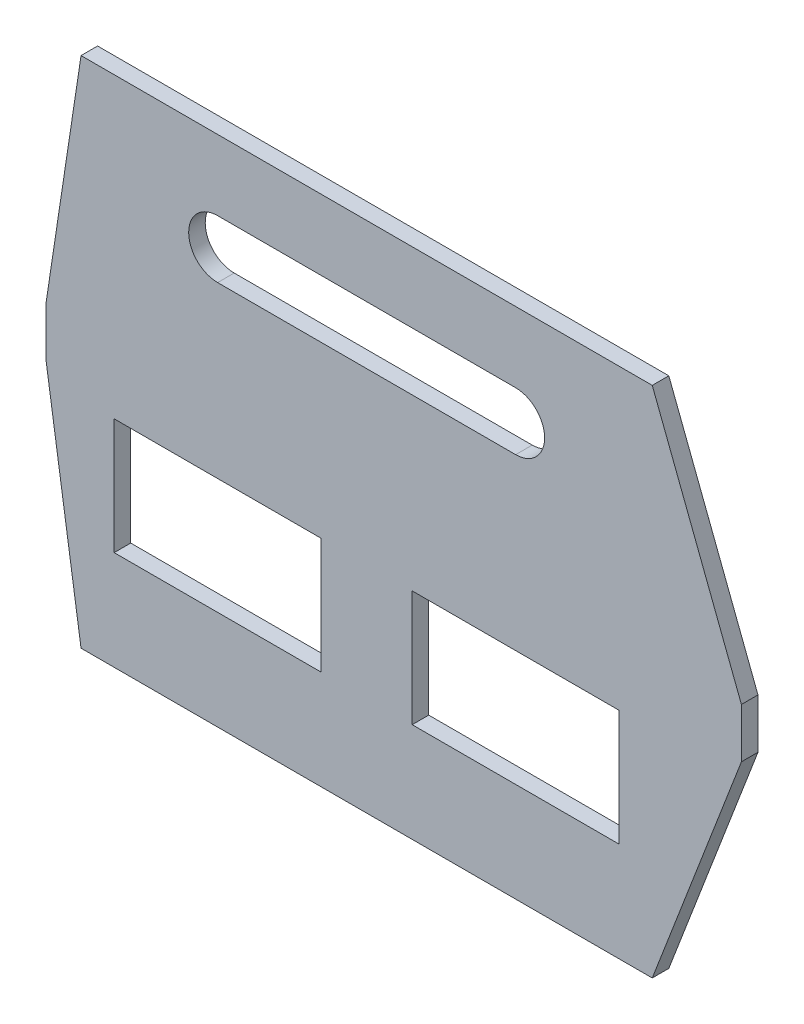
ISO-10303-21;
HEADER;
FILE_DESCRIPTION(('STEP AP214'),'2;1');
FILE_NAME('part.step','',(''),(''),'','','');
FILE_SCHEMA(('AUTOMOTIVE_DESIGN { 1 0 10303 214 1 1 1 1 }'));
ENDSEC;
DATA;
#1=APPLICATION_CONTEXT('core data for automotive mechanical design processes');
#2=APPLICATION_PROTOCOL_DEFINITION('international standard','automotive_design',2000,#1);
#3=PRODUCT_CONTEXT('',#1,'mechanical');
#4=PRODUCT('Part','Part','',(#3));
#5=PRODUCT_RELATED_PRODUCT_CATEGORY('part','',(#4));
#6=PRODUCT_DEFINITION_FORMATION('','',#4);
#7=PRODUCT_DEFINITION_CONTEXT('part definition',#1,'design');
#8=PRODUCT_DEFINITION('design','',#6,#7);
#9=PRODUCT_DEFINITION_SHAPE('','',#8);
#10=(LENGTH_UNIT() NAMED_UNIT(*) SI_UNIT(.MILLI.,.METRE.));
#11=(NAMED_UNIT(*) PLANE_ANGLE_UNIT() SI_UNIT($,.RADIAN.));
#12=(NAMED_UNIT(*) SI_UNIT($,.STERADIAN.) SOLID_ANGLE_UNIT());
#13=UNCERTAINTY_MEASURE_WITH_UNIT(LENGTH_MEASURE(1.E-05),#10,'distance_accuracy_value','');
#14=(GEOMETRIC_REPRESENTATION_CONTEXT(3) GLOBAL_UNCERTAINTY_ASSIGNED_CONTEXT((#13)) GLOBAL_UNIT_ASSIGNED_CONTEXT((#10,
#11,#12)) REPRESENTATION_CONTEXT('',''));
#15=CARTESIAN_POINT('',(0.,0.,0.));
#16=DIRECTION('',(0.,0.,1.));
#17=DIRECTION('',(1.,0.,0.));
#18=AXIS2_PLACEMENT_3D('',#15,#16,#17);
#19=CARTESIAN_POINT('',(0.,0.,10.));
#20=DIRECTION('',(0.,0.,-1.));
#21=DIRECTION('',(-1.,0.,0.));
#22=AXIS2_PLACEMENT_3D('',#19,#20,#21);
#23=PLANE('',#22);
#24=DIRECTION('',(0.,-1.,0.));
#25=VECTOR('',#24,1.);
#26=CARTESIAN_POINT('',(-325.,130.,10.));
#27=LINE('',#26,#25);
#28=CARTESIAN_POINT('',(-325.,130.,10.));
#29=VERTEX_POINT('',#28);
#30=CARTESIAN_POINT('',(-325.,60.,10.));
#31=VERTEX_POINT('',#30);
#32=EDGE_CURVE('E229',#29,#31,#27,.T.);
#33=ORIENTED_EDGE('',*,*,#32,.F.);
#34=DIRECTION('',(-1.,0.,0.));
#35=VECTOR('',#34,1.);
#36=CARTESIAN_POINT('',(-325.,130.,10.));
#37=LINE('',#36,#35);
#38=CARTESIAN_POINT('',(-200.,130.,10.));
#39=VERTEX_POINT('',#38);
#40=EDGE_CURVE('E240',#39,#29,#37,.T.);
#41=ORIENTED_EDGE('',*,*,#40,.F.);
#42=DIRECTION('',(0.,1.,0.));
#43=VECTOR('',#42,1.);
#44=CARTESIAN_POINT('',(-200.,130.,10.));
#45=LINE('',#44,#43);
#46=CARTESIAN_POINT('',(-200.,60.,10.));
#47=VERTEX_POINT('',#46);
#48=EDGE_CURVE('E236',#47,#39,#45,.T.);
#49=ORIENTED_EDGE('',*,*,#48,.F.);
#50=DIRECTION('',(1.,0.,0.));
#51=VECTOR('',#50,1.);
#52=CARTESIAN_POINT('',(-325.,60.,10.));
#53=LINE('',#52,#51);
#54=EDGE_CURVE('E232',#31,#47,#53,.T.);
#55=ORIENTED_EDGE('',*,*,#54,.F.);
#56=EDGE_LOOP('',(#33,#41,#49,#55));
#57=FACE_BOUND('',#56,.T.);
#58=DIRECTION('',(0.359010987142301,0.933333333333333,0.));
#59=VECTOR('',#58,1.);
#60=CARTESIAN_POINT('',(53.8516480713451,140.,10.));
#61=LINE('',#60,#59);
#62=CARTESIAN_POINT('',(0.,0.,10.));
#63=VERTEX_POINT('',#62);
#64=CARTESIAN_POINT('',(53.8516480713451,140.,10.));
#65=VERTEX_POINT('',#64);
#66=EDGE_CURVE('E315',#63,#65,#61,.T.);
#67=ORIENTED_EDGE('',*,*,#66,.T.);
#68=DIRECTION('',(0.,1.,0.));
#69=VECTOR('',#68,1.);
#70=CARTESIAN_POINT('',(53.8516480713451,170.,10.));
#71=LINE('',#70,#69);
#72=CARTESIAN_POINT('',(53.8516480713451,170.,10.));
#73=VERTEX_POINT('',#72);
#74=EDGE_CURVE('E319',#65,#73,#71,.T.);
#75=ORIENTED_EDGE('',*,*,#74,.T.);
#76=DIRECTION('',(-0.359010987142301,0.933333333333333,0.));
#77=VECTOR('',#76,1.);
#78=CARTESIAN_POINT('',(0.,310.,10.));
#79=LINE('',#78,#77);
#80=CARTESIAN_POINT('',(0.,310.,10.));
#81=VERTEX_POINT('',#80);
#82=EDGE_CURVE('E323',#73,#81,#79,.T.);
#83=ORIENTED_EDGE('',*,*,#82,.T.);
#84=DIRECTION('',(-1.,0.,0.));
#85=VECTOR('',#84,1.);
#86=CARTESIAN_POINT('',(-345.,310.,10.));
#87=LINE('',#86,#85);
#88=CARTESIAN_POINT('',(-345.,310.,10.));
#89=VERTEX_POINT('',#88);
#90=EDGE_CURVE('E326',#81,#89,#87,.T.);
#91=ORIENTED_EDGE('',*,*,#90,.T.);
#92=DIRECTION('',(-0.149365086770144,-0.988782114954628,0.));
#93=VECTOR('',#92,1.);
#94=CARTESIAN_POINT('',(-366.148351928655,170.,10.));
#95=LINE('',#94,#93);
#96=CARTESIAN_POINT('',(-366.148351928655,170.,10.));
#97=VERTEX_POINT('',#96);
#98=EDGE_CURVE('E329',#89,#97,#95,.T.);
#99=ORIENTED_EDGE('',*,*,#98,.T.);
#100=DIRECTION('',(0.,-1.,0.));
#101=VECTOR('',#100,1.);
#102=CARTESIAN_POINT('',(-366.148351928655,140.,10.));
#103=LINE('',#102,#101);
#104=CARTESIAN_POINT('',(-366.148351928655,140.,10.));
#105=VERTEX_POINT('',#104);
#106=EDGE_CURVE('E332',#97,#105,#103,.T.);
#107=ORIENTED_EDGE('',*,*,#106,.T.);
#108=DIRECTION('',(0.149365086770144,-0.988782114954628,0.));
#109=VECTOR('',#108,1.);
#110=CARTESIAN_POINT('',(-345.,0.,10.));
#111=LINE('',#110,#109);
#112=CARTESIAN_POINT('',(-345.,0.,10.));
#113=VERTEX_POINT('',#112);
#114=EDGE_CURVE('E335',#105,#113,#111,.T.);
#115=ORIENTED_EDGE('',*,*,#114,.T.);
#116=DIRECTION('',(1.,0.,0.));
#117=VECTOR('',#116,1.);
#118=CARTESIAN_POINT('',(0.,0.,10.));
#119=LINE('',#118,#117);
#120=EDGE_CURVE('E338',#113,#63,#119,.T.);
#121=ORIENTED_EDGE('',*,*,#120,.T.);
#122=EDGE_LOOP('',(#67,#75,#83,#91,#99,#107,#115,#121));
#123=FACE_BOUND('',#122,.T.);
#124=CARTESIAN_POINT('',(-262.5,250.,10.));
#125=DIRECTION('',(0.,0.,1.));
#126=DIRECTION('',(1.,0.,0.));
#127=AXIS2_PLACEMENT_3D('',#124,#125,#126);
#128=CIRCLE('',#127,17.5);
#129=CARTESIAN_POINT('',(-262.5,267.5,10.));
#130=VERTEX_POINT('',#129);
#131=CARTESIAN_POINT('',(-262.5,232.5,10.));
#132=VERTEX_POINT('',#131);
#133=EDGE_CURVE('E272',#130,#132,#128,.T.);
#134=ORIENTED_EDGE('',*,*,#133,.F.);
#135=DIRECTION('',(-1.,0.,0.));
#136=VECTOR('',#135,1.);
#137=CARTESIAN_POINT('',(-262.5,267.5,10.));
#138=LINE('',#137,#136);
#139=CARTESIAN_POINT('',(-82.4999999999999,267.5,10.));
#140=VERTEX_POINT('',#139);
#141=EDGE_CURVE('E283',#140,#130,#138,.T.);
#142=ORIENTED_EDGE('',*,*,#141,.F.);
#143=CARTESIAN_POINT('',(-82.4999999999999,250.,10.));
#144=DIRECTION('',(0.,0.,1.));
#145=DIRECTION('',(1.,0.,0.));
#146=AXIS2_PLACEMENT_3D('',#143,#144,#145);
#147=CIRCLE('',#146,17.5);
#148=CARTESIAN_POINT('',(-82.4999999999999,232.5,10.));
#149=VERTEX_POINT('',#148);
#150=EDGE_CURVE('E279',#149,#140,#147,.T.);
#151=ORIENTED_EDGE('',*,*,#150,.F.);
#152=DIRECTION('',(1.,0.,0.));
#153=VECTOR('',#152,1.);
#154=CARTESIAN_POINT('',(-262.5,232.5,10.));
#155=LINE('',#154,#153);
#156=EDGE_CURVE('E275',#132,#149,#155,.T.);
#157=ORIENTED_EDGE('',*,*,#156,.F.);
#158=EDGE_LOOP('',(#134,#142,#151,#157));
#159=FACE_BOUND('',#158,.T.);
#160=DIRECTION('',(0.,1.,0.));
#161=VECTOR('',#160,1.);
#162=CARTESIAN_POINT('',(-20.,130.,10.));
#163=LINE('',#162,#161);
#164=CARTESIAN_POINT('',(-20.,60.,10.));
#165=VERTEX_POINT('',#164);
#166=CARTESIAN_POINT('',(-20.,130.,10.));
#167=VERTEX_POINT('',#166);
#168=EDGE_CURVE('E181',#165,#167,#163,.T.);
#169=ORIENTED_EDGE('',*,*,#168,.F.);
#170=DIRECTION('',(1.,0.,0.));
#171=VECTOR('',#170,1.);
#172=CARTESIAN_POINT('',(-20.,60.,10.));
#173=LINE('',#172,#171);
#174=CARTESIAN_POINT('',(-145.,60.,10.));
#175=VERTEX_POINT('',#174);
#176=EDGE_CURVE('E207',#175,#165,#173,.T.);
#177=ORIENTED_EDGE('',*,*,#176,.F.);
#178=DIRECTION('',(0.,-1.,0.));
#179=VECTOR('',#178,1.);
#180=CARTESIAN_POINT('',(-145.,130.,10.));
#181=LINE('',#180,#179);
#182=CARTESIAN_POINT('',(-145.,130.,10.));
#183=VERTEX_POINT('',#182);
#184=EDGE_CURVE('E203',#183,#175,#181,.T.);
#185=ORIENTED_EDGE('',*,*,#184,.F.);
#186=DIRECTION('',(-1.,0.,0.));
#187=VECTOR('',#186,1.);
#188=CARTESIAN_POINT('',(-20.,130.,10.));
#189=LINE('',#188,#187);
#190=EDGE_CURVE('E190',#167,#183,#189,.T.);
#191=ORIENTED_EDGE('',*,*,#190,.F.);
#192=EDGE_LOOP('',(#169,#177,#185,#191));
#193=FACE_BOUND('',#192,.T.);
#194=ADVANCED_FACE('F43',(#57,#123,#159,#193),#23,.F.);
#195=CARTESIAN_POINT('',(0.,0.,0.));
#196=DIRECTION('',(0.,0.,-1.));
#197=DIRECTION('',(-1.,0.,0.));
#198=AXIS2_PLACEMENT_3D('',#195,#196,#197);
#199=PLANE('',#198);
#200=DIRECTION('',(0.359010987142301,0.933333333333333,0.));
#201=VECTOR('',#200,1.);
#202=CARTESIAN_POINT('',(53.8516480713451,140.,0.));
#203=LINE('',#202,#201);
#204=CARTESIAN_POINT('',(0.,0.,0.));
#205=VERTEX_POINT('',#204);
#206=CARTESIAN_POINT('',(53.8516480713451,140.,0.));
#207=VERTEX_POINT('',#206);
#208=EDGE_CURVE('E314',#205,#207,#203,.T.);
#209=ORIENTED_EDGE('',*,*,#208,.F.);
#210=DIRECTION('',(1.,0.,0.));
#211=VECTOR('',#210,1.);
#212=CARTESIAN_POINT('',(0.,0.,0.));
#213=LINE('',#212,#211);
#214=CARTESIAN_POINT('',(-345.,0.,0.));
#215=VERTEX_POINT('',#214);
#216=EDGE_CURVE('E320',#215,#205,#213,.T.);
#217=ORIENTED_EDGE('',*,*,#216,.F.);
#218=DIRECTION('',(0.149365086770144,-0.988782114954628,0.));
#219=VECTOR('',#218,1.);
#220=CARTESIAN_POINT('',(-345.,0.,0.));
#221=LINE('',#220,#219);
#222=CARTESIAN_POINT('',(-366.148351928655,140.,0.));
#223=VERTEX_POINT('',#222);
#224=EDGE_CURVE('E360',#223,#215,#221,.T.);
#225=ORIENTED_EDGE('',*,*,#224,.F.);
#226=DIRECTION('',(0.,-1.,0.));
#227=VECTOR('',#226,1.);
#228=CARTESIAN_POINT('',(-366.148351928655,140.,0.));
#229=LINE('',#228,#227);
#230=CARTESIAN_POINT('',(-366.148351928655,170.,0.));
#231=VERTEX_POINT('',#230);
#232=EDGE_CURVE('E357',#231,#223,#229,.T.);
#233=ORIENTED_EDGE('',*,*,#232,.F.);
#234=DIRECTION('',(-0.149365086770144,-0.988782114954628,0.));
#235=VECTOR('',#234,1.);
#236=CARTESIAN_POINT('',(-366.148351928655,170.,0.));
#237=LINE('',#236,#235);
#238=CARTESIAN_POINT('',(-345.,310.,0.));
#239=VERTEX_POINT('',#238);
#240=EDGE_CURVE('E354',#239,#231,#237,.T.);
#241=ORIENTED_EDGE('',*,*,#240,.F.);
#242=DIRECTION('',(-1.,0.,0.));
#243=VECTOR('',#242,1.);
#244=CARTESIAN_POINT('',(-345.,310.,0.));
#245=LINE('',#244,#243);
#246=CARTESIAN_POINT('',(0.,310.,0.));
#247=VERTEX_POINT('',#246);
#248=EDGE_CURVE('E351',#247,#239,#245,.T.);
#249=ORIENTED_EDGE('',*,*,#248,.F.);
#250=DIRECTION('',(-0.359010987142301,0.933333333333333,0.));
#251=VECTOR('',#250,1.);
#252=CARTESIAN_POINT('',(0.,310.,0.));
#253=LINE('',#252,#251);
#254=CARTESIAN_POINT('',(53.8516480713451,170.,0.));
#255=VERTEX_POINT('',#254);
#256=EDGE_CURVE('E348',#255,#247,#253,.T.);
#257=ORIENTED_EDGE('',*,*,#256,.F.);
#258=DIRECTION('',(0.,1.,0.));
#259=VECTOR('',#258,1.);
#260=CARTESIAN_POINT('',(53.8516480713451,170.,0.));
#261=LINE('',#260,#259);
#262=EDGE_CURVE('E345',#207,#255,#261,.T.);
#263=ORIENTED_EDGE('',*,*,#262,.F.);
#264=EDGE_LOOP('',(#209,#217,#225,#233,#241,#249,#257,#263));
#265=FACE_BOUND('',#264,.T.);
#266=DIRECTION('',(-1.,0.,0.));
#267=VECTOR('',#266,1.);
#268=CARTESIAN_POINT('',(-262.5,267.5,0.));
#269=LINE('',#268,#267);
#270=CARTESIAN_POINT('',(-82.4999999999999,267.5,0.));
#271=VERTEX_POINT('',#270);
#272=CARTESIAN_POINT('',(-262.5,267.5,0.));
#273=VERTEX_POINT('',#272);
#274=EDGE_CURVE('E276',#271,#273,#269,.T.);
#275=ORIENTED_EDGE('',*,*,#274,.T.);
#276=CARTESIAN_POINT('',(-262.5,250.,0.));
#277=DIRECTION('',(0.,0.,1.));
#278=DIRECTION('',(1.,0.,0.));
#279=AXIS2_PLACEMENT_3D('',#276,#277,#278);
#280=CIRCLE('',#279,17.5);
#281=CARTESIAN_POINT('',(-262.5,232.5,0.));
#282=VERTEX_POINT('',#281);
#283=EDGE_CURVE('E271',#273,#282,#280,.T.);
#284=ORIENTED_EDGE('',*,*,#283,.T.);
#285=DIRECTION('',(1.,0.,0.));
#286=VECTOR('',#285,1.);
#287=CARTESIAN_POINT('',(-262.5,232.5,0.));
#288=LINE('',#287,#286);
#289=CARTESIAN_POINT('',(-82.4999999999999,232.5,0.));
#290=VERTEX_POINT('',#289);
#291=EDGE_CURVE('E290',#282,#290,#288,.T.);
#292=ORIENTED_EDGE('',*,*,#291,.T.);
#293=CARTESIAN_POINT('',(-82.4999999999999,250.,0.));
#294=DIRECTION('',(0.,0.,1.));
#295=DIRECTION('',(1.,0.,0.));
#296=AXIS2_PLACEMENT_3D('',#293,#294,#295);
#297=CIRCLE('',#296,17.5);
#298=EDGE_CURVE('E294',#290,#271,#297,.T.);
#299=ORIENTED_EDGE('',*,*,#298,.T.);
#300=EDGE_LOOP('',(#275,#284,#292,#299));
#301=FACE_BOUND('',#300,.T.);
#302=DIRECTION('',(-1.,0.,0.));
#303=VECTOR('',#302,1.);
#304=CARTESIAN_POINT('',(-325.,130.,0.));
#305=LINE('',#304,#303);
#306=CARTESIAN_POINT('',(-200.,130.,0.));
#307=VERTEX_POINT('',#306);
#308=CARTESIAN_POINT('',(-325.,130.,0.));
#309=VERTEX_POINT('',#308);
#310=EDGE_CURVE('E233',#307,#309,#305,.T.);
#311=ORIENTED_EDGE('',*,*,#310,.T.);
#312=DIRECTION('',(0.,-1.,0.));
#313=VECTOR('',#312,1.);
#314=CARTESIAN_POINT('',(-325.,130.,0.));
#315=LINE('',#314,#313);
#316=CARTESIAN_POINT('',(-325.,60.,0.));
#317=VERTEX_POINT('',#316);
#318=EDGE_CURVE('E199',#309,#317,#315,.T.);
#319=ORIENTED_EDGE('',*,*,#318,.T.);
#320=DIRECTION('',(1.,0.,0.));
#321=VECTOR('',#320,1.);
#322=CARTESIAN_POINT('',(-325.,60.,0.));
#323=LINE('',#322,#321);
#324=CARTESIAN_POINT('',(-200.,60.,0.));
#325=VERTEX_POINT('',#324);
#326=EDGE_CURVE('E247',#317,#325,#323,.T.);
#327=ORIENTED_EDGE('',*,*,#326,.T.);
#328=DIRECTION('',(0.,1.,0.));
#329=VECTOR('',#328,1.);
#330=CARTESIAN_POINT('',(-200.,130.,0.));
#331=LINE('',#330,#329);
#332=EDGE_CURVE('E251',#325,#307,#331,.T.);
#333=ORIENTED_EDGE('',*,*,#332,.T.);
#334=EDGE_LOOP('',(#311,#319,#327,#333));
#335=FACE_BOUND('',#334,.T.);
#336=DIRECTION('',(1.,0.,0.));
#337=VECTOR('',#336,1.);
#338=CARTESIAN_POINT('',(-20.,60.,0.));
#339=LINE('',#338,#337);
#340=CARTESIAN_POINT('',(-145.,60.,0.));
#341=VERTEX_POINT('',#340);
#342=CARTESIAN_POINT('',(-20.,60.,0.));
#343=VERTEX_POINT('',#342);
#344=EDGE_CURVE('E191',#341,#343,#339,.T.);
#345=ORIENTED_EDGE('',*,*,#344,.T.);
#346=DIRECTION('',(0.,1.,0.));
#347=VECTOR('',#346,1.);
#348=CARTESIAN_POINT('',(-20.,130.,0.));
#349=LINE('',#348,#347);
#350=CARTESIAN_POINT('',(-20.,130.,0.));
#351=VERTEX_POINT('',#350);
#352=EDGE_CURVE('E67',#343,#351,#349,.T.);
#353=ORIENTED_EDGE('',*,*,#352,.T.);
#354=DIRECTION('',(-1.,0.,0.));
#355=VECTOR('',#354,1.);
#356=CARTESIAN_POINT('',(-20.,130.,0.));
#357=LINE('',#356,#355);
#358=CARTESIAN_POINT('',(-145.,130.,0.));
#359=VERTEX_POINT('',#358);
#360=EDGE_CURVE('E197',#351,#359,#357,.T.);
#361=ORIENTED_EDGE('',*,*,#360,.T.);
#362=DIRECTION('',(0.,-1.,0.));
#363=VECTOR('',#362,1.);
#364=CARTESIAN_POINT('',(-145.,130.,0.));
#365=LINE('',#364,#363);
#366=EDGE_CURVE('E216',#359,#341,#365,.T.);
#367=ORIENTED_EDGE('',*,*,#366,.T.);
#368=EDGE_LOOP('',(#345,#353,#361,#367));
#369=FACE_BOUND('',#368,.T.);
#370=ADVANCED_FACE('F399',(#265,#301,#335,#369),#199,.T.);
#371=CARTESIAN_POINT('',(53.8516480713451,140.,10.));
#372=DIRECTION('',(-0.933333333333333,0.359010987142301,0.));
#373=DIRECTION('',(-0.359010987142301,-0.933333333333333,0.));
#374=AXIS2_PLACEMENT_3D('',#371,#372,#373);
#375=PLANE('',#374);
#376=ORIENTED_EDGE('',*,*,#208,.T.);
#377=DIRECTION('',(0.,0.,-1.));
#378=VECTOR('',#377,1.);
#379=CARTESIAN_POINT('',(53.8516480713451,140.,10.));
#380=LINE('',#379,#378);
#381=EDGE_CURVE('E11',#65,#207,#380,.T.);
#382=ORIENTED_EDGE('',*,*,#381,.F.);
#383=ORIENTED_EDGE('',*,*,#66,.F.);
#384=DIRECTION('',(0.,0.,-1.));
#385=VECTOR('',#384,1.);
#386=CARTESIAN_POINT('',(0.,0.,10.));
#387=LINE('',#386,#385);
#388=EDGE_CURVE('E341',#63,#205,#387,.T.);
#389=ORIENTED_EDGE('',*,*,#388,.T.);
#390=EDGE_LOOP('',(#376,#382,#383,#389));
#391=FACE_BOUND('',#390,.T.);
#392=ADVANCED_FACE('F45',(#391),#375,.F.);
#393=CARTESIAN_POINT('',(53.8516480713451,170.,10.));
#394=DIRECTION('',(-1.,0.,0.));
#395=DIRECTION('',(0.,-1.,0.));
#396=AXIS2_PLACEMENT_3D('',#393,#394,#395);
#397=PLANE('',#396);
#398=ORIENTED_EDGE('',*,*,#262,.T.);
#399=DIRECTION('',(0.,0.,-1.));
#400=VECTOR('',#399,1.);
#401=CARTESIAN_POINT('',(53.8516480713451,170.,10.));
#402=LINE('',#401,#400);
#403=EDGE_CURVE('E52',#73,#255,#402,.T.);
#404=ORIENTED_EDGE('',*,*,#403,.F.);
#405=ORIENTED_EDGE('',*,*,#74,.F.);
#406=ORIENTED_EDGE('',*,*,#381,.T.);
#407=EDGE_LOOP('',(#398,#404,#405,#406));
#408=FACE_BOUND('',#407,.T.);
#409=ADVANCED_FACE('F417',(#408),#397,.F.);
#410=CARTESIAN_POINT('',(0.,310.,10.));
#411=DIRECTION('',(-0.933333333333333,-0.359010987142301,0.));
#412=DIRECTION('',(0.359010987142301,-0.933333333333333,0.));
#413=AXIS2_PLACEMENT_3D('',#410,#411,#412);
#414=PLANE('',#413);
#415=ORIENTED_EDGE('',*,*,#256,.T.);
#416=DIRECTION('',(0.,0.,-1.));
#417=VECTOR('',#416,1.);
#418=CARTESIAN_POINT('',(0.,310.,10.));
#419=LINE('',#418,#417);
#420=EDGE_CURVE('E384',#81,#247,#419,.T.);
#421=ORIENTED_EDGE('',*,*,#420,.F.);
#422=ORIENTED_EDGE('',*,*,#82,.F.);
#423=ORIENTED_EDGE('',*,*,#403,.T.);
#424=EDGE_LOOP('',(#415,#421,#422,#423));
#425=FACE_BOUND('',#424,.T.);
#426=ADVANCED_FACE('F393',(#425),#414,.F.);
#427=CARTESIAN_POINT('',(-345.,310.,10.));
#428=DIRECTION('',(0.,-1.,0.));
#429=DIRECTION('',(1.,0.,0.));
#430=AXIS2_PLACEMENT_3D('',#427,#428,#429);
#431=PLANE('',#430);
#432=ORIENTED_EDGE('',*,*,#248,.T.);
#433=DIRECTION('',(0.,0.,-1.));
#434=VECTOR('',#433,1.);
#435=CARTESIAN_POINT('',(-345.,310.,10.));
#436=LINE('',#435,#434);
#437=EDGE_CURVE('E380',#89,#239,#436,.T.);
#438=ORIENTED_EDGE('',*,*,#437,.F.);
#439=ORIENTED_EDGE('',*,*,#90,.F.);
#440=ORIENTED_EDGE('',*,*,#420,.T.);
#441=EDGE_LOOP('',(#432,#438,#439,#440));
#442=FACE_BOUND('',#441,.T.);
#443=ADVANCED_FACE('F405',(#442),#431,.F.);
#444=CARTESIAN_POINT('',(-366.148351928655,170.,10.));
#445=DIRECTION('',(0.988782114954628,-0.149365086770144,0.));
#446=DIRECTION('',(0.149365086770144,0.988782114954628,0.));
#447=AXIS2_PLACEMENT_3D('',#444,#445,#446);
#448=PLANE('',#447);
#449=ORIENTED_EDGE('',*,*,#240,.T.);
#450=DIRECTION('',(0.,0.,-1.));
#451=VECTOR('',#450,1.);
#452=CARTESIAN_POINT('',(-366.148351928655,170.,10.));
#453=LINE('',#452,#451);
#454=EDGE_CURVE('E376',#97,#231,#453,.T.);
#455=ORIENTED_EDGE('',*,*,#454,.F.);
#456=ORIENTED_EDGE('',*,*,#98,.F.);
#457=ORIENTED_EDGE('',*,*,#437,.T.);
#458=EDGE_LOOP('',(#449,#455,#456,#457));
#459=FACE_BOUND('',#458,.T.);
#460=ADVANCED_FACE('F409',(#459),#448,.F.);
#461=CARTESIAN_POINT('',(-366.148351928655,140.,10.));
#462=DIRECTION('',(1.,0.,0.));
#463=DIRECTION('',(0.,0.,-1.));
#464=AXIS2_PLACEMENT_3D('',#461,#462,#463);
#465=PLANE('',#464);
#466=ORIENTED_EDGE('',*,*,#232,.T.);
#467=DIRECTION('',(0.,0.,-1.));
#468=VECTOR('',#467,1.);
#469=CARTESIAN_POINT('',(-366.148351928655,140.,10.));
#470=LINE('',#469,#468);
#471=EDGE_CURVE('E372',#105,#223,#470,.T.);
#472=ORIENTED_EDGE('',*,*,#471,.F.);
#473=ORIENTED_EDGE('',*,*,#106,.F.);
#474=ORIENTED_EDGE('',*,*,#454,.T.);
#475=EDGE_LOOP('',(#466,#472,#473,#474));
#476=FACE_BOUND('',#475,.T.);
#477=ADVANCED_FACE('F430',(#476),#465,.F.);
#478=CARTESIAN_POINT('',(-345.,0.,10.));
#479=DIRECTION('',(0.988782114954628,0.149365086770144,0.));
#480=DIRECTION('',(-0.149365086770144,0.988782114954628,0.));
#481=AXIS2_PLACEMENT_3D('',#478,#479,#480);
#482=PLANE('',#481);
#483=ORIENTED_EDGE('',*,*,#224,.T.);
#484=DIRECTION('',(0.,0.,-1.));
#485=VECTOR('',#484,1.);
#486=CARTESIAN_POINT('',(-345.,0.,10.));
#487=LINE('',#486,#485);
#488=EDGE_CURVE('E368',#113,#215,#487,.T.);
#489=ORIENTED_EDGE('',*,*,#488,.F.);
#490=ORIENTED_EDGE('',*,*,#114,.F.);
#491=ORIENTED_EDGE('',*,*,#471,.T.);
#492=EDGE_LOOP('',(#483,#489,#490,#491));
#493=FACE_BOUND('',#492,.T.);
#494=ADVANCED_FACE('F428',(#493),#482,.F.);
#495=CARTESIAN_POINT('',(0.,0.,10.));
#496=DIRECTION('',(0.,1.,0.));
#497=DIRECTION('',(-1.,0.,0.));
#498=AXIS2_PLACEMENT_3D('',#495,#496,#497);
#499=PLANE('',#498);
#500=ORIENTED_EDGE('',*,*,#216,.T.);
#501=ORIENTED_EDGE('',*,*,#388,.F.);
#502=ORIENTED_EDGE('',*,*,#120,.F.);
#503=ORIENTED_EDGE('',*,*,#488,.T.);
#504=EDGE_LOOP('',(#500,#501,#502,#503));
#505=FACE_BOUND('',#504,.T.);
#506=ADVANCED_FACE('F423',(#505),#499,.F.);
#507=CARTESIAN_POINT('',(-262.5,250.,10.));
#508=DIRECTION('',(0.,0.,-1.));
#509=DIRECTION('',(-1.,0.,0.));
#510=AXIS2_PLACEMENT_3D('',#507,#508,#509);
#511=CYLINDRICAL_SURFACE('',#510,17.5);
#512=ORIENTED_EDGE('',*,*,#283,.F.);
#513=DIRECTION('',(0.,0.,-1.));
#514=VECTOR('',#513,1.);
#515=CARTESIAN_POINT('',(-262.5,267.5,10.));
#516=LINE('',#515,#514);
#517=EDGE_CURVE('E286',#130,#273,#516,.T.);
#518=ORIENTED_EDGE('',*,*,#517,.F.);
#519=ORIENTED_EDGE('',*,*,#133,.T.);
#520=DIRECTION('',(0.,0.,-1.));
#521=VECTOR('',#520,1.);
#522=CARTESIAN_POINT('',(-262.5,232.5,10.));
#523=LINE('',#522,#521);
#524=EDGE_CURVE('E310',#132,#282,#523,.T.);
#525=ORIENTED_EDGE('',*,*,#524,.T.);
#526=EDGE_LOOP('',(#512,#518,#519,#525));
#527=FACE_BOUND('',#526,.T.);
#528=ADVANCED_FACE('F448',(#527),#511,.F.);
#529=CARTESIAN_POINT('',(-262.5,232.5,10.));
#530=DIRECTION('',(0.,1.,0.));
#531=DIRECTION('',(-1.,0.,0.));
#532=AXIS2_PLACEMENT_3D('',#529,#530,#531);
#533=PLANE('',#532);
#534=ORIENTED_EDGE('',*,*,#291,.F.);
#535=ORIENTED_EDGE('',*,*,#524,.F.);
#536=ORIENTED_EDGE('',*,*,#156,.T.);
#537=DIRECTION('',(0.,0.,-1.));
#538=VECTOR('',#537,1.);
#539=CARTESIAN_POINT('',(-82.4999999999999,232.5,10.));
#540=LINE('',#539,#538);
#541=EDGE_CURVE('E307',#149,#290,#540,.T.);
#542=ORIENTED_EDGE('',*,*,#541,.T.);
#543=EDGE_LOOP('',(#534,#535,#536,#542));
#544=FACE_BOUND('',#543,.T.);
#545=ADVANCED_FACE('F455',(#544),#533,.T.);
#546=CARTESIAN_POINT('',(-82.4999999999999,250.,10.));
#547=DIRECTION('',(0.,0.,-1.));
#548=DIRECTION('',(-1.,0.,0.));
#549=AXIS2_PLACEMENT_3D('',#546,#547,#548);
#550=CYLINDRICAL_SURFACE('',#549,17.5);
#551=ORIENTED_EDGE('',*,*,#298,.F.);
#552=ORIENTED_EDGE('',*,*,#541,.F.);
#553=ORIENTED_EDGE('',*,*,#150,.T.);
#554=DIRECTION('',(0.,0.,-1.));
#555=VECTOR('',#554,1.);
#556=CARTESIAN_POINT('',(-82.4999999999999,267.5,10.));
#557=LINE('',#556,#555);
#558=EDGE_CURVE('E304',#140,#271,#557,.T.);
#559=ORIENTED_EDGE('',*,*,#558,.T.);
#560=EDGE_LOOP('',(#551,#552,#553,#559));
#561=FACE_BOUND('',#560,.T.);
#562=ADVANCED_FACE('F460',(#561),#550,.F.);
#563=CARTESIAN_POINT('',(-262.5,267.5,10.));
#564=DIRECTION('',(0.,-1.,0.));
#565=DIRECTION('',(0.,0.,-1.));
#566=AXIS2_PLACEMENT_3D('',#563,#564,#565);
#567=PLANE('',#566);
#568=ORIENTED_EDGE('',*,*,#274,.F.);
#569=ORIENTED_EDGE('',*,*,#558,.F.);
#570=ORIENTED_EDGE('',*,*,#141,.T.);
#571=ORIENTED_EDGE('',*,*,#517,.T.);
#572=EDGE_LOOP('',(#568,#569,#570,#571));
#573=FACE_BOUND('',#572,.T.);
#574=ADVANCED_FACE('F467',(#573),#567,.T.);
#575=CARTESIAN_POINT('',(-325.,130.,10.));
#576=DIRECTION('',(1.,0.,0.));
#577=DIRECTION('',(0.,0.,-1.));
#578=AXIS2_PLACEMENT_3D('',#575,#576,#577);
#579=PLANE('',#578);
#580=ORIENTED_EDGE('',*,*,#318,.F.);
#581=DIRECTION('',(0.,0.,-1.));
#582=VECTOR('',#581,1.);
#583=CARTESIAN_POINT('',(-325.,130.,10.));
#584=LINE('',#583,#582);
#585=EDGE_CURVE('E243',#29,#309,#584,.T.);
#586=ORIENTED_EDGE('',*,*,#585,.F.);
#587=ORIENTED_EDGE('',*,*,#32,.T.);
#588=DIRECTION('',(0.,0.,-1.));
#589=VECTOR('',#588,1.);
#590=CARTESIAN_POINT('',(-325.,60.,10.));
#591=LINE('',#590,#589);
#592=EDGE_CURVE('E267',#31,#317,#591,.T.);
#593=ORIENTED_EDGE('',*,*,#592,.T.);
#594=EDGE_LOOP('',(#580,#586,#587,#593));
#595=FACE_BOUND('',#594,.T.);
#596=ADVANCED_FACE('F480',(#595),#579,.T.);
#597=CARTESIAN_POINT('',(-325.,60.,10.));
#598=DIRECTION('',(0.,1.,0.));
#599=DIRECTION('',(0.,0.,1.));
#600=AXIS2_PLACEMENT_3D('',#597,#598,#599);
#601=PLANE('',#600);
#602=ORIENTED_EDGE('',*,*,#326,.F.);
#603=ORIENTED_EDGE('',*,*,#592,.F.);
#604=ORIENTED_EDGE('',*,*,#54,.T.);
#605=DIRECTION('',(0.,0.,-1.));
#606=VECTOR('',#605,1.);
#607=CARTESIAN_POINT('',(-200.,60.,10.));
#608=LINE('',#607,#606);
#609=EDGE_CURVE('E264',#47,#325,#608,.T.);
#610=ORIENTED_EDGE('',*,*,#609,.T.);
#611=EDGE_LOOP('',(#602,#603,#604,#610));
#612=FACE_BOUND('',#611,.T.);
#613=ADVANCED_FACE('F485',(#612),#601,.T.);
#614=CARTESIAN_POINT('',(-200.,130.,10.));
#615=DIRECTION('',(-1.,0.,0.));
#616=DIRECTION('',(0.,0.,1.));
#617=AXIS2_PLACEMENT_3D('',#614,#615,#616);
#618=PLANE('',#617);
#619=ORIENTED_EDGE('',*,*,#332,.F.);
#620=ORIENTED_EDGE('',*,*,#609,.F.);
#621=ORIENTED_EDGE('',*,*,#48,.T.);
#622=DIRECTION('',(0.,0.,-1.));
#623=VECTOR('',#622,1.);
#624=CARTESIAN_POINT('',(-200.,130.,10.));
#625=LINE('',#624,#623);
#626=EDGE_CURVE('E261',#39,#307,#625,.T.);
#627=ORIENTED_EDGE('',*,*,#626,.T.);
#628=EDGE_LOOP('',(#619,#620,#621,#627));
#629=FACE_BOUND('',#628,.T.);
#630=ADVANCED_FACE('F489',(#629),#618,.T.);
#631=CARTESIAN_POINT('',(-325.,130.,10.));
#632=DIRECTION('',(0.,-1.,0.));
#633=DIRECTION('',(0.,0.,-1.));
#634=AXIS2_PLACEMENT_3D('',#631,#632,#633);
#635=PLANE('',#634);
#636=ORIENTED_EDGE('',*,*,#310,.F.);
#637=ORIENTED_EDGE('',*,*,#626,.F.);
#638=ORIENTED_EDGE('',*,*,#40,.T.);
#639=ORIENTED_EDGE('',*,*,#585,.T.);
#640=EDGE_LOOP('',(#636,#637,#638,#639));
#641=FACE_BOUND('',#640,.T.);
#642=ADVANCED_FACE('F493',(#641),#635,.T.);
#643=CARTESIAN_POINT('',(-20.,130.,10.));
#644=DIRECTION('',(-1.,0.,0.));
#645=DIRECTION('',(0.,-1.,0.));
#646=AXIS2_PLACEMENT_3D('',#643,#644,#645);
#647=PLANE('',#646);
#648=ORIENTED_EDGE('',*,*,#352,.F.);
#649=DIRECTION('',(0.,0.,-1.));
#650=VECTOR('',#649,1.);
#651=CARTESIAN_POINT('',(-20.,60.,10.));
#652=LINE('',#651,#650);
#653=EDGE_CURVE('E185',#165,#343,#652,.T.);
#654=ORIENTED_EDGE('',*,*,#653,.F.);
#655=ORIENTED_EDGE('',*,*,#168,.T.);
#656=DIRECTION('',(0.,0.,-1.));
#657=VECTOR('',#656,1.);
#658=CARTESIAN_POINT('',(-20.,130.,10.));
#659=LINE('',#658,#657);
#660=EDGE_CURVE('E184',#167,#351,#659,.T.);
#661=ORIENTED_EDGE('',*,*,#660,.T.);
#662=EDGE_LOOP('',(#648,#654,#655,#661));
#663=FACE_BOUND('',#662,.T.);
#664=ADVANCED_FACE('F183',(#663),#647,.T.);
#665=CARTESIAN_POINT('',(-20.,130.,10.));
#666=DIRECTION('',(0.,-1.,0.));
#667=DIRECTION('',(1.,0.,0.));
#668=AXIS2_PLACEMENT_3D('',#665,#666,#667);
#669=PLANE('',#668);
#670=ORIENTED_EDGE('',*,*,#360,.F.);
#671=ORIENTED_EDGE('',*,*,#660,.F.);
#672=ORIENTED_EDGE('',*,*,#190,.T.);
#673=DIRECTION('',(0.,0.,-1.));
#674=VECTOR('',#673,1.);
#675=CARTESIAN_POINT('',(-145.,130.,10.));
#676=LINE('',#675,#674);
#677=EDGE_CURVE('E200',#183,#359,#676,.T.);
#678=ORIENTED_EDGE('',*,*,#677,.T.);
#679=EDGE_LOOP('',(#670,#671,#672,#678));
#680=FACE_BOUND('',#679,.T.);
#681=ADVANCED_FACE('F194',(#680),#669,.T.);
#682=CARTESIAN_POINT('',(-145.,130.,10.));
#683=DIRECTION('',(1.,0.,0.));
#684=DIRECTION('',(0.,0.,-1.));
#685=AXIS2_PLACEMENT_3D('',#682,#683,#684);
#686=PLANE('',#685);
#687=ORIENTED_EDGE('',*,*,#366,.F.);
#688=ORIENTED_EDGE('',*,*,#677,.F.);
#689=ORIENTED_EDGE('',*,*,#184,.T.);
#690=DIRECTION('',(0.,0.,-1.));
#691=VECTOR('',#690,1.);
#692=CARTESIAN_POINT('',(-145.,60.,10.));
#693=LINE('',#692,#691);
#694=EDGE_CURVE('E59',#175,#341,#693,.T.);
#695=ORIENTED_EDGE('',*,*,#694,.T.);
#696=EDGE_LOOP('',(#687,#688,#689,#695));
#697=FACE_BOUND('',#696,.T.);
#698=ADVANCED_FACE('F502',(#697),#686,.T.);
#699=CARTESIAN_POINT('',(-20.,60.,10.));
#700=DIRECTION('',(0.,1.,0.));
#701=DIRECTION('',(-1.,0.,0.));
#702=AXIS2_PLACEMENT_3D('',#699,#700,#701);
#703=PLANE('',#702);
#704=ORIENTED_EDGE('',*,*,#344,.F.);
#705=ORIENTED_EDGE('',*,*,#694,.F.);
#706=ORIENTED_EDGE('',*,*,#176,.T.);
#707=ORIENTED_EDGE('',*,*,#653,.T.);
#708=EDGE_LOOP('',(#704,#705,#706,#707));
#709=FACE_BOUND('',#708,.T.);
#710=ADVANCED_FACE('F505',(#709),#703,.T.);
#711=CLOSED_SHELL('',(#194,#370,#392,#409,#426,#443,#460,#477,#494,#506,#528,#545,#562,#574,
#596,#613,#630,#642,#664,#681,#698,#710));
#712=MANIFOLD_SOLID_BREP('B2',#711);
#713=ADVANCED_BREP_SHAPE_REPRESENTATION('',(#18,#712),#14);
#714=SHAPE_DEFINITION_REPRESENTATION(#9,#713);
ENDSEC;
END-ISO-10303-21;
